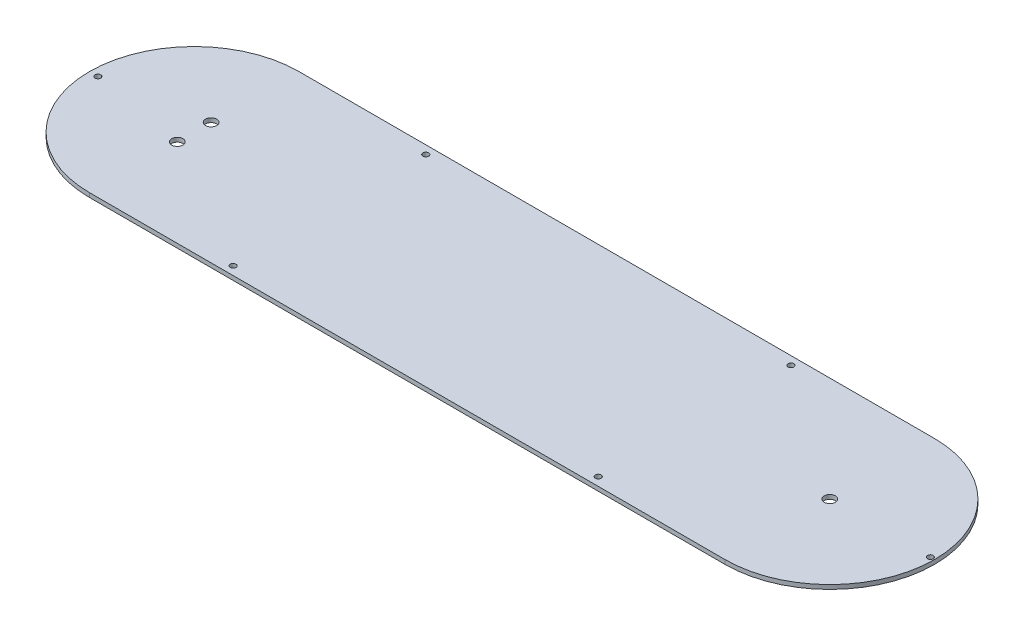
ISO-10303-21;
HEADER;
FILE_DESCRIPTION(('STEP AP214'),'2;1');
FILE_NAME('part.step','',(''),(''),'','','');
FILE_SCHEMA(('AUTOMOTIVE_DESIGN { 1 0 10303 214 1 1 1 1 }'));
ENDSEC;
DATA;
#1=APPLICATION_CONTEXT('core data for automotive mechanical design processes');
#2=APPLICATION_PROTOCOL_DEFINITION('international standard','automotive_design',2000,#1);
#3=PRODUCT_CONTEXT('',#1,'mechanical');
#4=PRODUCT('Part','Part','',(#3));
#5=PRODUCT_RELATED_PRODUCT_CATEGORY('part','',(#4));
#6=PRODUCT_DEFINITION_FORMATION('','',#4);
#7=PRODUCT_DEFINITION_CONTEXT('part definition',#1,'design');
#8=PRODUCT_DEFINITION('design','',#6,#7);
#9=PRODUCT_DEFINITION_SHAPE('','',#8);
#10=(LENGTH_UNIT() NAMED_UNIT(*) SI_UNIT(.MILLI.,.METRE.));
#11=(NAMED_UNIT(*) PLANE_ANGLE_UNIT() SI_UNIT($,.RADIAN.));
#12=(NAMED_UNIT(*) SI_UNIT($,.STERADIAN.) SOLID_ANGLE_UNIT());
#13=UNCERTAINTY_MEASURE_WITH_UNIT(LENGTH_MEASURE(1.E-05),#10,'distance_accuracy_value','');
#14=(GEOMETRIC_REPRESENTATION_CONTEXT(3) GLOBAL_UNCERTAINTY_ASSIGNED_CONTEXT((#13)) GLOBAL_UNIT_ASSIGNED_CONTEXT((#10,
#11,#12)) REPRESENTATION_CONTEXT('',''));
#15=CARTESIAN_POINT('',(0.,0.,0.));
#16=DIRECTION('',(0.,0.,1.));
#17=DIRECTION('',(1.,0.,0.));
#18=AXIS2_PLACEMENT_3D('',#15,#16,#17);
#19=CARTESIAN_POINT('',(0.,1.5875,0.));
#20=DIRECTION('',(0.,1.,0.));
#21=DIRECTION('',(0.,0.,1.));
#22=AXIS2_PLACEMENT_3D('',#19,#20,#21);
#23=PLANE('',#22);
#24=CARTESIAN_POINT('',(0.,1.5875,6.35));
#25=DIRECTION('',(0.,1.,0.));
#26=DIRECTION('',(0.,0.,1.));
#27=AXIS2_PLACEMENT_3D('',#24,#25,#26);
#28=CIRCLE('',#27,2.1);
#29=CARTESIAN_POINT('',(0.,1.5875,8.45));
#30=VERTEX_POINT('',#29);
#31=EDGE_CURVE('E153',#30,#30,#28,.T.);
#32=ORIENTED_EDGE('',*,*,#31,.F.);
#33=EDGE_LOOP('',(#32));
#34=FACE_BOUND('',#33,.T.);
#35=CARTESIAN_POINT('',(276.5425,1.5875,0.));
#36=DIRECTION('',(0.,1.,0.));
#37=DIRECTION('',(0.,0.,1.));
#38=AXIS2_PLACEMENT_3D('',#35,#36,#37);
#39=CIRCLE('',#38,1.09220000000001);
#40=CARTESIAN_POINT('',(276.5425,1.5875,1.09220000000001));
#41=VERTEX_POINT('',#40);
#42=EDGE_CURVE('E141',#41,#41,#39,.T.);
#43=ORIENTED_EDGE('',*,*,#42,.F.);
#44=EDGE_LOOP('',(#43));
#45=FACE_BOUND('',#44,.T.);
#46=CARTESIAN_POINT('',(187.96,1.5875,36.195));
#47=DIRECTION('',(0.,1.,0.));
#48=DIRECTION('',(0.,0.,-1.));
#49=AXIS2_PLACEMENT_3D('',#46,#47,#48);
#50=CIRCLE('',#49,1.09219999999998);
#51=CARTESIAN_POINT('',(187.96,1.5875,35.1028));
#52=VERTEX_POINT('',#51);
#53=EDGE_CURVE('E129',#52,#52,#50,.T.);
#54=ORIENTED_EDGE('',*,*,#53,.F.);
#55=EDGE_LOOP('',(#54));
#56=FACE_BOUND('',#55,.T.);
#57=CARTESIAN_POINT('',(187.96,1.5875,-36.195));
#58=DIRECTION('',(0.,1.,0.));
#59=DIRECTION('',(0.,0.,1.));
#60=AXIS2_PLACEMENT_3D('',#57,#58,#59);
#61=CIRCLE('',#60,1.09219999999998);
#62=CARTESIAN_POINT('',(187.96,1.5875,-35.1028));
#63=VERTEX_POINT('',#62);
#64=EDGE_CURVE('E117',#63,#63,#61,.T.);
#65=ORIENTED_EDGE('',*,*,#64,.F.);
#66=EDGE_LOOP('',(#65));
#67=FACE_BOUND('',#66,.T.);
#68=CARTESIAN_POINT('',(0.,1.5875,0.));
#69=DIRECTION('',(0.,1.,0.));
#70=DIRECTION('',(0.,0.,1.));
#71=AXIS2_PLACEMENT_3D('',#68,#69,#70);
#72=CIRCLE('',#71,39.37);
#73=CARTESIAN_POINT('',(0.,1.5875,-39.37));
#74=VERTEX_POINT('',#73);
#75=CARTESIAN_POINT('',(0.,1.5875,39.37));
#76=VERTEX_POINT('',#75);
#77=EDGE_CURVE('E87',#74,#76,#72,.T.);
#78=ORIENTED_EDGE('',*,*,#77,.T.);
#79=DIRECTION('',(1.,0.,0.));
#80=VECTOR('',#79,1.);
#81=CARTESIAN_POINT('',(0.,1.5875,39.37));
#82=LINE('',#81,#80);
#83=CARTESIAN_POINT('',(238.76,1.5875,39.37));
#84=VERTEX_POINT('',#83);
#85=EDGE_CURVE('E82',#76,#84,#82,.T.);
#86=ORIENTED_EDGE('',*,*,#85,.T.);
#87=CARTESIAN_POINT('',(238.76,1.5875,0.));
#88=DIRECTION('',(0.,1.,0.));
#89=DIRECTION('',(0.,0.,1.));
#90=AXIS2_PLACEMENT_3D('',#87,#88,#89);
#91=CIRCLE('',#90,39.37);
#92=CARTESIAN_POINT('',(238.76,1.5875,-39.37));
#93=VERTEX_POINT('',#92);
#94=EDGE_CURVE('E85',#84,#93,#91,.T.);
#95=ORIENTED_EDGE('',*,*,#94,.T.);
#96=DIRECTION('',(-1.,0.,0.));
#97=VECTOR('',#96,1.);
#98=CARTESIAN_POINT('',(0.,1.5875,-39.37));
#99=LINE('',#98,#97);
#100=EDGE_CURVE('E52',#93,#74,#99,.T.);
#101=ORIENTED_EDGE('',*,*,#100,.T.);
#102=EDGE_LOOP('',(#78,#86,#95,#101));
#103=FACE_BOUND('',#102,.T.);
#104=CARTESIAN_POINT('',(50.8,1.5875,-36.195));
#105=DIRECTION('',(0.,1.,0.));
#106=DIRECTION('',(0.,0.,1.));
#107=AXIS2_PLACEMENT_3D('',#104,#105,#106);
#108=CIRCLE('',#107,1.0922);
#109=CARTESIAN_POINT('',(50.8,1.5875,-35.1028));
#110=VERTEX_POINT('',#109);
#111=EDGE_CURVE('E102',#110,#110,#108,.T.);
#112=ORIENTED_EDGE('',*,*,#111,.F.);
#113=EDGE_LOOP('',(#112));
#114=FACE_BOUND('',#113,.T.);
#115=CARTESIAN_POINT('',(50.8,1.5875,36.195));
#116=DIRECTION('',(0.,1.,0.));
#117=DIRECTION('',(0.,0.,-1.));
#118=AXIS2_PLACEMENT_3D('',#115,#116,#117);
#119=CIRCLE('',#118,1.0922);
#120=CARTESIAN_POINT('',(50.8,1.5875,35.1028));
#121=VERTEX_POINT('',#120);
#122=EDGE_CURVE('E123',#121,#121,#119,.T.);
#123=ORIENTED_EDGE('',*,*,#122,.F.);
#124=EDGE_LOOP('',(#123));
#125=FACE_BOUND('',#124,.T.);
#126=CARTESIAN_POINT('',(-36.195,1.5875,0.));
#127=DIRECTION('',(0.,1.,0.));
#128=DIRECTION('',(0.,0.,1.));
#129=AXIS2_PLACEMENT_3D('',#126,#127,#128);
#130=CIRCLE('',#129,1.0922);
#131=CARTESIAN_POINT('',(-36.195,1.5875,1.0922));
#132=VERTEX_POINT('',#131);
#133=EDGE_CURVE('E135',#132,#132,#130,.T.);
#134=ORIENTED_EDGE('',*,*,#133,.F.);
#135=EDGE_LOOP('',(#134));
#136=FACE_BOUND('',#135,.T.);
#137=CARTESIAN_POINT('',(238.76,1.5875,0.));
#138=DIRECTION('',(0.,1.,0.));
#139=DIRECTION('',(0.,0.,1.));
#140=AXIS2_PLACEMENT_3D('',#137,#138,#139);
#141=CIRCLE('',#140,2.09999999999999);
#142=CARTESIAN_POINT('',(238.76,1.5875,2.09999999999999));
#143=VERTEX_POINT('',#142);
#144=EDGE_CURVE('E147',#143,#143,#141,.T.);
#145=ORIENTED_EDGE('',*,*,#144,.F.);
#146=EDGE_LOOP('',(#145));
#147=FACE_BOUND('',#146,.T.);
#148=CARTESIAN_POINT('',(0.,1.5875,-6.35));
#149=DIRECTION('',(0.,1.,0.));
#150=DIRECTION('',(0.,0.,1.));
#151=AXIS2_PLACEMENT_3D('',#148,#149,#150);
#152=CIRCLE('',#151,2.1);
#153=CARTESIAN_POINT('',(0.,1.5875,-4.25));
#154=VERTEX_POINT('',#153);
#155=EDGE_CURVE('E159',#154,#154,#152,.T.);
#156=ORIENTED_EDGE('',*,*,#155,.F.);
#157=EDGE_LOOP('',(#156));
#158=FACE_BOUND('',#157,.T.);
#159=ADVANCED_FACE('F35',(#34,#45,#56,#67,#103,#114,#125,#136,#147,#158),#23,.T.);
#160=CARTESIAN_POINT('',(0.,0.,0.));
#161=DIRECTION('',(0.,1.,0.));
#162=DIRECTION('',(0.,0.,1.));
#163=AXIS2_PLACEMENT_3D('',#160,#161,#162);
#164=PLANE('',#163);
#165=CARTESIAN_POINT('',(0.,0.,6.35));
#166=DIRECTION('',(0.,1.,0.));
#167=DIRECTION('',(0.,0.,1.));
#168=AXIS2_PLACEMENT_3D('',#165,#166,#167);
#169=CIRCLE('',#168,2.1);
#170=CARTESIAN_POINT('',(0.,0.,8.45));
#171=VERTEX_POINT('',#170);
#172=EDGE_CURVE('E156',#171,#171,#169,.T.);
#173=ORIENTED_EDGE('',*,*,#172,.T.);
#174=EDGE_LOOP('',(#173));
#175=FACE_BOUND('',#174,.T.);
#176=CARTESIAN_POINT('',(276.5425,0.,0.));
#177=DIRECTION('',(0.,1.,0.));
#178=DIRECTION('',(0.,0.,1.));
#179=AXIS2_PLACEMENT_3D('',#176,#177,#178);
#180=CIRCLE('',#179,1.09220000000001);
#181=CARTESIAN_POINT('',(276.5425,0.,1.09220000000001));
#182=VERTEX_POINT('',#181);
#183=EDGE_CURVE('E144',#182,#182,#180,.T.);
#184=ORIENTED_EDGE('',*,*,#183,.T.);
#185=EDGE_LOOP('',(#184));
#186=FACE_BOUND('',#185,.T.);
#187=CARTESIAN_POINT('',(187.96,0.,36.195));
#188=DIRECTION('',(0.,1.,0.));
#189=DIRECTION('',(0.,0.,-1.));
#190=AXIS2_PLACEMENT_3D('',#187,#188,#189);
#191=CIRCLE('',#190,1.09219999999998);
#192=CARTESIAN_POINT('',(187.96,0.,35.1028));
#193=VERTEX_POINT('',#192);
#194=EDGE_CURVE('E132',#193,#193,#191,.T.);
#195=ORIENTED_EDGE('',*,*,#194,.T.);
#196=EDGE_LOOP('',(#195));
#197=FACE_BOUND('',#196,.T.);
#198=CARTESIAN_POINT('',(187.96,0.,-36.195));
#199=DIRECTION('',(0.,1.,0.));
#200=DIRECTION('',(0.,0.,1.));
#201=AXIS2_PLACEMENT_3D('',#198,#199,#200);
#202=CIRCLE('',#201,1.09219999999998);
#203=CARTESIAN_POINT('',(187.96,0.,-35.1028));
#204=VERTEX_POINT('',#203);
#205=EDGE_CURVE('E120',#204,#204,#202,.T.);
#206=ORIENTED_EDGE('',*,*,#205,.T.);
#207=EDGE_LOOP('',(#206));
#208=FACE_BOUND('',#207,.T.);
#209=CARTESIAN_POINT('',(0.,0.,0.));
#210=DIRECTION('',(0.,1.,0.));
#211=DIRECTION('',(0.,0.,1.));
#212=AXIS2_PLACEMENT_3D('',#209,#210,#211);
#213=CIRCLE('',#212,39.37);
#214=CARTESIAN_POINT('',(0.,0.,-39.37));
#215=VERTEX_POINT('',#214);
#216=CARTESIAN_POINT('',(0.,0.,39.37));
#217=VERTEX_POINT('',#216);
#218=EDGE_CURVE('E99',#215,#217,#213,.T.);
#219=ORIENTED_EDGE('',*,*,#218,.F.);
#220=DIRECTION('',(-1.,0.,0.));
#221=VECTOR('',#220,1.);
#222=CARTESIAN_POINT('',(0.,0.,-39.37));
#223=LINE('',#222,#221);
#224=CARTESIAN_POINT('',(238.76,0.,-39.37));
#225=VERTEX_POINT('',#224);
#226=EDGE_CURVE('E75',#225,#215,#223,.T.);
#227=ORIENTED_EDGE('',*,*,#226,.F.);
#228=CARTESIAN_POINT('',(238.76,0.,0.));
#229=DIRECTION('',(0.,1.,0.));
#230=DIRECTION('',(0.,0.,1.));
#231=AXIS2_PLACEMENT_3D('',#228,#229,#230);
#232=CIRCLE('',#231,39.37);
#233=CARTESIAN_POINT('',(238.76,0.,39.37));
#234=VERTEX_POINT('',#233);
#235=EDGE_CURVE('E69',#234,#225,#232,.T.);
#236=ORIENTED_EDGE('',*,*,#235,.F.);
#237=DIRECTION('',(1.,0.,0.));
#238=VECTOR('',#237,1.);
#239=CARTESIAN_POINT('',(0.,0.,39.37));
#240=LINE('',#239,#238);
#241=EDGE_CURVE('E91',#217,#234,#240,.T.);
#242=ORIENTED_EDGE('',*,*,#241,.F.);
#243=EDGE_LOOP('',(#219,#227,#236,#242));
#244=FACE_BOUND('',#243,.T.);
#245=CARTESIAN_POINT('',(50.8,0.,-36.195));
#246=DIRECTION('',(0.,1.,0.));
#247=DIRECTION('',(0.,0.,1.));
#248=AXIS2_PLACEMENT_3D('',#245,#246,#247);
#249=CIRCLE('',#248,1.0922);
#250=CARTESIAN_POINT('',(50.8,0.,-35.1028));
#251=VERTEX_POINT('',#250);
#252=EDGE_CURVE('E114',#251,#251,#249,.T.);
#253=ORIENTED_EDGE('',*,*,#252,.T.);
#254=EDGE_LOOP('',(#253));
#255=FACE_BOUND('',#254,.T.);
#256=CARTESIAN_POINT('',(50.8,0.,36.195));
#257=DIRECTION('',(0.,1.,0.));
#258=DIRECTION('',(0.,0.,-1.));
#259=AXIS2_PLACEMENT_3D('',#256,#257,#258);
#260=CIRCLE('',#259,1.0922);
#261=CARTESIAN_POINT('',(50.8,0.,35.1028));
#262=VERTEX_POINT('',#261);
#263=EDGE_CURVE('E126',#262,#262,#260,.T.);
#264=ORIENTED_EDGE('',*,*,#263,.T.);
#265=EDGE_LOOP('',(#264));
#266=FACE_BOUND('',#265,.T.);
#267=CARTESIAN_POINT('',(-36.195,0.,0.));
#268=DIRECTION('',(0.,1.,0.));
#269=DIRECTION('',(0.,0.,1.));
#270=AXIS2_PLACEMENT_3D('',#267,#268,#269);
#271=CIRCLE('',#270,1.0922);
#272=CARTESIAN_POINT('',(-36.195,0.,1.0922));
#273=VERTEX_POINT('',#272);
#274=EDGE_CURVE('E138',#273,#273,#271,.T.);
#275=ORIENTED_EDGE('',*,*,#274,.T.);
#276=EDGE_LOOP('',(#275));
#277=FACE_BOUND('',#276,.T.);
#278=CARTESIAN_POINT('',(238.76,0.,0.));
#279=DIRECTION('',(0.,1.,0.));
#280=DIRECTION('',(0.,0.,1.));
#281=AXIS2_PLACEMENT_3D('',#278,#279,#280);
#282=CIRCLE('',#281,2.09999999999999);
#283=CARTESIAN_POINT('',(238.76,0.,2.09999999999999));
#284=VERTEX_POINT('',#283);
#285=EDGE_CURVE('E150',#284,#284,#282,.T.);
#286=ORIENTED_EDGE('',*,*,#285,.T.);
#287=EDGE_LOOP('',(#286));
#288=FACE_BOUND('',#287,.T.);
#289=CARTESIAN_POINT('',(0.,0.,-6.35));
#290=DIRECTION('',(0.,1.,0.));
#291=DIRECTION('',(0.,0.,1.));
#292=AXIS2_PLACEMENT_3D('',#289,#290,#291);
#293=CIRCLE('',#292,2.1);
#294=CARTESIAN_POINT('',(0.,0.,-4.25));
#295=VERTEX_POINT('',#294);
#296=EDGE_CURVE('E162',#295,#295,#293,.T.);
#297=ORIENTED_EDGE('',*,*,#296,.T.);
#298=EDGE_LOOP('',(#297));
#299=FACE_BOUND('',#298,.T.);
#300=ADVANCED_FACE('F110',(#175,#186,#197,#208,#244,#255,#266,#277,#288,#299),#164,.F.);
#301=CARTESIAN_POINT('',(0.,1.5875,0.));
#302=DIRECTION('',(0.,-1.,0.));
#303=DIRECTION('',(0.,0.,-1.));
#304=AXIS2_PLACEMENT_3D('',#301,#302,#303);
#305=CYLINDRICAL_SURFACE('',#304,39.37);
#306=ORIENTED_EDGE('',*,*,#218,.T.);
#307=DIRECTION('',(0.,-1.,0.));
#308=VECTOR('',#307,1.);
#309=CARTESIAN_POINT('',(0.,1.5875,39.37));
#310=LINE('',#309,#308);
#311=EDGE_CURVE('E11',#76,#217,#310,.T.);
#312=ORIENTED_EDGE('',*,*,#311,.F.);
#313=ORIENTED_EDGE('',*,*,#77,.F.);
#314=DIRECTION('',(0.,-1.,0.));
#315=VECTOR('',#314,1.);
#316=CARTESIAN_POINT('',(0.,1.5875,-39.37));
#317=LINE('',#316,#315);
#318=EDGE_CURVE('E95',#74,#215,#317,.T.);
#319=ORIENTED_EDGE('',*,*,#318,.T.);
#320=EDGE_LOOP('',(#306,#312,#313,#319));
#321=FACE_BOUND('',#320,.T.);
#322=ADVANCED_FACE('F37',(#321),#305,.T.);
#323=CARTESIAN_POINT('',(0.,1.5875,39.37));
#324=DIRECTION('',(0.,0.,-1.));
#325=DIRECTION('',(-1.,0.,0.));
#326=AXIS2_PLACEMENT_3D('',#323,#324,#325);
#327=PLANE('',#326);
#328=ORIENTED_EDGE('',*,*,#241,.T.);
#329=DIRECTION('',(0.,-1.,0.));
#330=VECTOR('',#329,1.);
#331=CARTESIAN_POINT('',(238.76,1.5875,39.37));
#332=LINE('',#331,#330);
#333=EDGE_CURVE('E44',#84,#234,#332,.T.);
#334=ORIENTED_EDGE('',*,*,#333,.F.);
#335=ORIENTED_EDGE('',*,*,#85,.F.);
#336=ORIENTED_EDGE('',*,*,#311,.T.);
#337=EDGE_LOOP('',(#328,#334,#335,#336));
#338=FACE_BOUND('',#337,.T.);
#339=ADVANCED_FACE('F90',(#338),#327,.F.);
#340=CARTESIAN_POINT('',(238.76,1.5875,0.));
#341=DIRECTION('',(0.,-1.,0.));
#342=DIRECTION('',(0.,0.,-1.));
#343=AXIS2_PLACEMENT_3D('',#340,#341,#342);
#344=CYLINDRICAL_SURFACE('',#343,39.37);
#345=ORIENTED_EDGE('',*,*,#235,.T.);
#346=DIRECTION('',(0.,-1.,0.));
#347=VECTOR('',#346,1.);
#348=CARTESIAN_POINT('',(238.76,1.5875,-39.37));
#349=LINE('',#348,#347);
#350=EDGE_CURVE('E92',#93,#225,#349,.T.);
#351=ORIENTED_EDGE('',*,*,#350,.F.);
#352=ORIENTED_EDGE('',*,*,#94,.F.);
#353=ORIENTED_EDGE('',*,*,#333,.T.);
#354=EDGE_LOOP('',(#345,#351,#352,#353));
#355=FACE_BOUND('',#354,.T.);
#356=ADVANCED_FACE('F93',(#355),#344,.T.);
#357=CARTESIAN_POINT('',(0.,1.5875,-39.37));
#358=DIRECTION('',(0.,0.,1.));
#359=DIRECTION('',(1.,0.,0.));
#360=AXIS2_PLACEMENT_3D('',#357,#358,#359);
#361=PLANE('',#360);
#362=ORIENTED_EDGE('',*,*,#226,.T.);
#363=ORIENTED_EDGE('',*,*,#318,.F.);
#364=ORIENTED_EDGE('',*,*,#100,.F.);
#365=ORIENTED_EDGE('',*,*,#350,.T.);
#366=EDGE_LOOP('',(#362,#363,#364,#365));
#367=FACE_BOUND('',#366,.T.);
#368=ADVANCED_FACE('F107',(#367),#361,.F.);
#369=CARTESIAN_POINT('',(50.8,1.5875,-36.195));
#370=DIRECTION('',(0.,-1.,0.));
#371=DIRECTION('',(0.,0.,-1.));
#372=AXIS2_PLACEMENT_3D('',#369,#370,#371);
#373=CYLINDRICAL_SURFACE('',#372,1.0922);
#374=ORIENTED_EDGE('',*,*,#111,.T.);
#375=EDGE_LOOP('',(#374));
#376=FACE_BOUND('',#375,.T.);
#377=ORIENTED_EDGE('',*,*,#252,.F.);
#378=EDGE_LOOP('',(#377));
#379=FACE_BOUND('',#378,.T.);
#380=ADVANCED_FACE('F182',(#376,#379),#373,.F.);
#381=CARTESIAN_POINT('',(187.96,1.5875,-36.195));
#382=DIRECTION('',(0.,-1.,0.));
#383=DIRECTION('',(0.,0.,-1.));
#384=AXIS2_PLACEMENT_3D('',#381,#382,#383);
#385=CYLINDRICAL_SURFACE('',#384,1.09219999999998);
#386=ORIENTED_EDGE('',*,*,#64,.T.);
#387=EDGE_LOOP('',(#386));
#388=FACE_BOUND('',#387,.T.);
#389=ORIENTED_EDGE('',*,*,#205,.F.);
#390=EDGE_LOOP('',(#389));
#391=FACE_BOUND('',#390,.T.);
#392=ADVANCED_FACE('F228',(#388,#391),#385,.F.);
#393=CARTESIAN_POINT('',(50.8,1.5875,36.195));
#394=DIRECTION('',(0.,-1.,0.));
#395=DIRECTION('',(0.,0.,-1.));
#396=AXIS2_PLACEMENT_3D('',#393,#394,#395);
#397=CYLINDRICAL_SURFACE('',#396,1.0922);
#398=ORIENTED_EDGE('',*,*,#122,.T.);
#399=EDGE_LOOP('',(#398));
#400=FACE_BOUND('',#399,.T.);
#401=ORIENTED_EDGE('',*,*,#263,.F.);
#402=EDGE_LOOP('',(#401));
#403=FACE_BOUND('',#402,.T.);
#404=ADVANCED_FACE('F236',(#400,#403),#397,.F.);
#405=CARTESIAN_POINT('',(187.96,1.5875,36.195));
#406=DIRECTION('',(0.,-1.,0.));
#407=DIRECTION('',(0.,0.,-1.));
#408=AXIS2_PLACEMENT_3D('',#405,#406,#407);
#409=CYLINDRICAL_SURFACE('',#408,1.09219999999998);
#410=ORIENTED_EDGE('',*,*,#53,.T.);
#411=EDGE_LOOP('',(#410));
#412=FACE_BOUND('',#411,.T.);
#413=ORIENTED_EDGE('',*,*,#194,.F.);
#414=EDGE_LOOP('',(#413));
#415=FACE_BOUND('',#414,.T.);
#416=ADVANCED_FACE('F244',(#412,#415),#409,.F.);
#417=CARTESIAN_POINT('',(-36.195,1.5875,0.));
#418=DIRECTION('',(0.,-1.,0.));
#419=DIRECTION('',(0.,0.,-1.));
#420=AXIS2_PLACEMENT_3D('',#417,#418,#419);
#421=CYLINDRICAL_SURFACE('',#420,1.0922);
#422=ORIENTED_EDGE('',*,*,#133,.T.);
#423=EDGE_LOOP('',(#422));
#424=FACE_BOUND('',#423,.T.);
#425=ORIENTED_EDGE('',*,*,#274,.F.);
#426=EDGE_LOOP('',(#425));
#427=FACE_BOUND('',#426,.T.);
#428=ADVANCED_FACE('F253',(#424,#427),#421,.F.);
#429=CARTESIAN_POINT('',(276.5425,1.5875,0.));
#430=DIRECTION('',(0.,-1.,0.));
#431=DIRECTION('',(0.,0.,-1.));
#432=AXIS2_PLACEMENT_3D('',#429,#430,#431);
#433=CYLINDRICAL_SURFACE('',#432,1.09220000000001);
#434=ORIENTED_EDGE('',*,*,#42,.T.);
#435=EDGE_LOOP('',(#434));
#436=FACE_BOUND('',#435,.T.);
#437=ORIENTED_EDGE('',*,*,#183,.F.);
#438=EDGE_LOOP('',(#437));
#439=FACE_BOUND('',#438,.T.);
#440=ADVANCED_FACE('F262',(#436,#439),#433,.F.);
#441=CARTESIAN_POINT('',(238.76,1.5875,0.));
#442=DIRECTION('',(0.,-1.,0.));
#443=DIRECTION('',(0.,0.,-1.));
#444=AXIS2_PLACEMENT_3D('',#441,#442,#443);
#445=CYLINDRICAL_SURFACE('',#444,2.09999999999999);
#446=ORIENTED_EDGE('',*,*,#144,.T.);
#447=EDGE_LOOP('',(#446));
#448=FACE_BOUND('',#447,.T.);
#449=ORIENTED_EDGE('',*,*,#285,.F.);
#450=EDGE_LOOP('',(#449));
#451=FACE_BOUND('',#450,.T.);
#452=ADVANCED_FACE('F271',(#448,#451),#445,.F.);
#453=CARTESIAN_POINT('',(0.,1.5875,6.35));
#454=DIRECTION('',(0.,-1.,0.));
#455=DIRECTION('',(0.,0.,-1.));
#456=AXIS2_PLACEMENT_3D('',#453,#454,#455);
#457=CYLINDRICAL_SURFACE('',#456,2.1);
#458=ORIENTED_EDGE('',*,*,#31,.T.);
#459=EDGE_LOOP('',(#458));
#460=FACE_BOUND('',#459,.T.);
#461=ORIENTED_EDGE('',*,*,#172,.F.);
#462=EDGE_LOOP('',(#461));
#463=FACE_BOUND('',#462,.T.);
#464=ADVANCED_FACE('F280',(#460,#463),#457,.F.);
#465=CARTESIAN_POINT('',(0.,1.5875,-6.35));
#466=DIRECTION('',(0.,-1.,0.));
#467=DIRECTION('',(0.,0.,-1.));
#468=AXIS2_PLACEMENT_3D('',#465,#466,#467);
#469=CYLINDRICAL_SURFACE('',#468,2.1);
#470=ORIENTED_EDGE('',*,*,#155,.T.);
#471=EDGE_LOOP('',(#470));
#472=FACE_BOUND('',#471,.T.);
#473=ORIENTED_EDGE('',*,*,#296,.F.);
#474=EDGE_LOOP('',(#473));
#475=FACE_BOUND('',#474,.T.);
#476=ADVANCED_FACE('F168',(#472,#475),#469,.F.);
#477=CLOSED_SHELL('',(#159,#300,#322,#339,#356,#368,#380,#392,#404,#416,#428,#440,#452,#464,#476));
#478=MANIFOLD_SOLID_BREP('B2',#477);
#479=ADVANCED_BREP_SHAPE_REPRESENTATION('',(#18,#478),#14);
#480=SHAPE_DEFINITION_REPRESENTATION(#9,#479);
ENDSEC;
END-ISO-10303-21;
